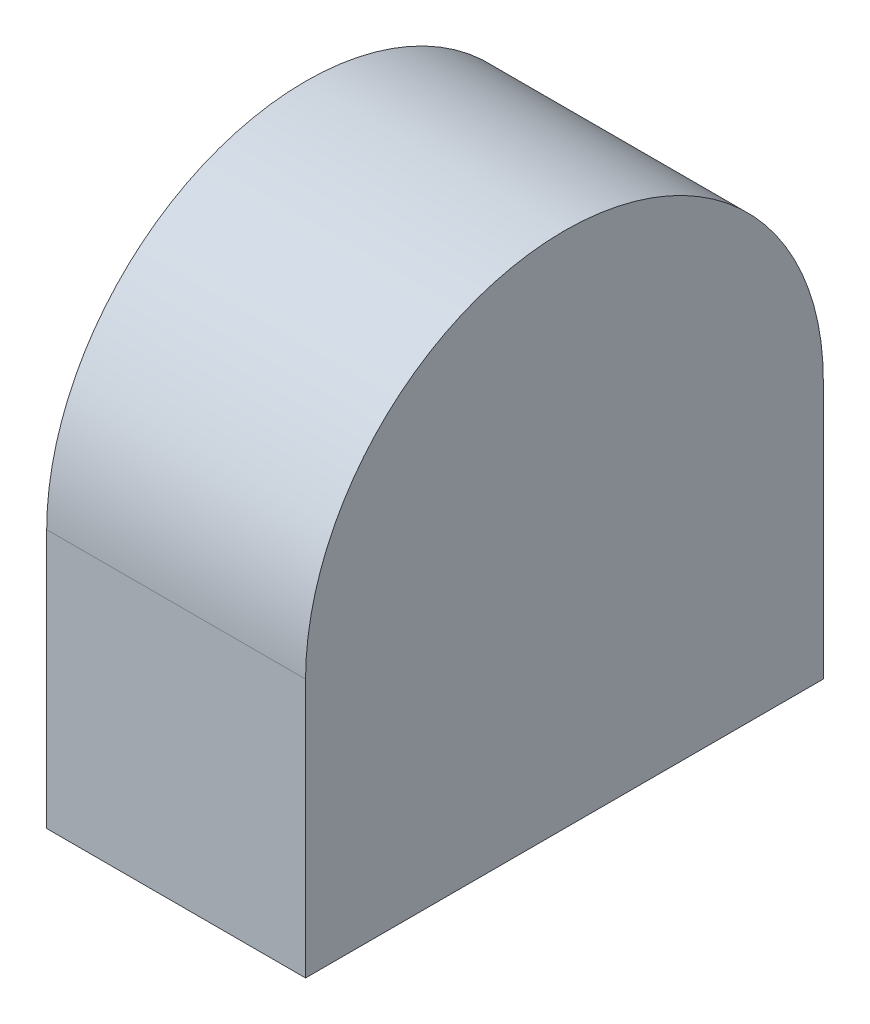
ISO-10303-21;
HEADER;
FILE_DESCRIPTION(('STEP AP214'),'2;1');
FILE_NAME('part.step','',(''),(''),'','','');
FILE_SCHEMA(('AUTOMOTIVE_DESIGN { 1 0 10303 214 1 1 1 1 }'));
ENDSEC;
DATA;
#1=APPLICATION_CONTEXT('core data for automotive mechanical design processes');
#2=APPLICATION_PROTOCOL_DEFINITION('international standard','automotive_design',2000,#1);
#3=PRODUCT_CONTEXT('',#1,'mechanical');
#4=PRODUCT('Part','Part','',(#3));
#5=PRODUCT_RELATED_PRODUCT_CATEGORY('part','',(#4));
#6=PRODUCT_DEFINITION_FORMATION('','',#4);
#7=PRODUCT_DEFINITION_CONTEXT('part definition',#1,'design');
#8=PRODUCT_DEFINITION('design','',#6,#7);
#9=PRODUCT_DEFINITION_SHAPE('','',#8);
#10=(LENGTH_UNIT() NAMED_UNIT(*) SI_UNIT(.MILLI.,.METRE.));
#11=(NAMED_UNIT(*) PLANE_ANGLE_UNIT() SI_UNIT($,.RADIAN.));
#12=(NAMED_UNIT(*) SI_UNIT($,.STERADIAN.) SOLID_ANGLE_UNIT());
#13=UNCERTAINTY_MEASURE_WITH_UNIT(LENGTH_MEASURE(1.E-05),#10,'distance_accuracy_value','');
#14=(GEOMETRIC_REPRESENTATION_CONTEXT(3) GLOBAL_UNCERTAINTY_ASSIGNED_CONTEXT((#13)) GLOBAL_UNIT_ASSIGNED_CONTEXT((#10,
#11,#12)) REPRESENTATION_CONTEXT('',''));
#15=CARTESIAN_POINT('',(0.,0.,0.));
#16=DIRECTION('',(0.,0.,1.));
#17=DIRECTION('',(1.,0.,0.));
#18=AXIS2_PLACEMENT_3D('',#15,#16,#17);
#19=CARTESIAN_POINT('',(0.,10.,-10.));
#20=DIRECTION('',(-1.,0.,0.));
#21=DIRECTION('',(0.,0.,1.));
#22=AXIS2_PLACEMENT_3D('',#19,#20,#21);
#23=CYLINDRICAL_SURFACE('',#22,10.);
#24=DIRECTION('',(-1.,0.,0.));
#25=VECTOR('',#24,1.);
#26=CARTESIAN_POINT('',(0.,10.,-20.));
#27=LINE('',#26,#25);
#28=CARTESIAN_POINT('',(0.,10.,-20.));
#29=VERTEX_POINT('',#28);
#30=CARTESIAN_POINT('',(10.,10.,-20.));
#31=VERTEX_POINT('',#30);
#32=EDGE_CURVE('E96',#29,#31,#27,.F.);
#33=ORIENTED_EDGE('',*,*,#32,.F.);
#34=CARTESIAN_POINT('',(0.,10.,-10.));
#35=DIRECTION('',(1.,0.,0.));
#36=DIRECTION('',(0.,0.,-1.));
#37=AXIS2_PLACEMENT_3D('',#34,#35,#36);
#38=CIRCLE('',#37,10.);
#39=CARTESIAN_POINT('',(0.,10.,0.));
#40=VERTEX_POINT('',#39);
#41=EDGE_CURVE('E56',#40,#29,#38,.F.);
#42=ORIENTED_EDGE('',*,*,#41,.F.);
#43=DIRECTION('',(-1.,0.,0.));
#44=VECTOR('',#43,1.);
#45=CARTESIAN_POINT('',(0.,10.,0.));
#46=LINE('',#45,#44);
#47=CARTESIAN_POINT('',(10.,10.,0.));
#48=VERTEX_POINT('',#47);
#49=EDGE_CURVE('E92',#48,#40,#46,.T.);
#50=ORIENTED_EDGE('',*,*,#49,.F.);
#51=CARTESIAN_POINT('',(10.,10.,-10.));
#52=DIRECTION('',(-1.,0.,0.));
#53=DIRECTION('',(0.,0.,1.));
#54=AXIS2_PLACEMENT_3D('',#51,#52,#53);
#55=CIRCLE('',#54,10.);
#56=EDGE_CURVE('E11',#31,#48,#55,.F.);
#57=ORIENTED_EDGE('',*,*,#56,.F.);
#58=EDGE_LOOP('',(#33,#42,#50,#57));
#59=FACE_BOUND('',#58,.T.);
#60=ADVANCED_FACE('F47',(#59),#23,.T.);
#61=CARTESIAN_POINT('',(0.,20.,0.));
#62=DIRECTION('',(1.,0.,0.));
#63=DIRECTION('',(0.,0.,-1.));
#64=AXIS2_PLACEMENT_3D('',#61,#62,#63);
#65=PLANE('',#64);
#66=CARTESIAN_POINT('',(0.,13.,-10.));
#67=DIRECTION('',(-1.,0.,0.));
#68=DIRECTION('',(0.,0.,1.));
#69=AXIS2_PLACEMENT_3D('',#66,#67,#68);
#70=CIRCLE('',#69,2.);
#71=CARTESIAN_POINT('',(0.,13.,-8.));
#72=VERTEX_POINT('',#71);
#73=EDGE_CURVE('E117',#72,#72,#70,.T.);
#74=ORIENTED_EDGE('',*,*,#73,.F.);
#75=EDGE_LOOP('',(#74));
#76=FACE_BOUND('',#75,.T.);
#77=DIRECTION('',(0.,-1.,0.));
#78=VECTOR('',#77,1.);
#79=CARTESIAN_POINT('',(0.,20.,0.));
#80=LINE('',#79,#78);
#81=CARTESIAN_POINT('',(0.,0.,0.));
#82=VERTEX_POINT('',#81);
#83=EDGE_CURVE('E86',#40,#82,#80,.T.);
#84=ORIENTED_EDGE('',*,*,#83,.F.);
#85=ORIENTED_EDGE('',*,*,#41,.T.);
#86=DIRECTION('',(0.,-1.,0.));
#87=VECTOR('',#86,1.);
#88=CARTESIAN_POINT('',(0.,20.,-20.));
#89=LINE('',#88,#87);
#90=CARTESIAN_POINT('',(0.,0.,-20.));
#91=VERTEX_POINT('',#90);
#92=EDGE_CURVE('E110',#29,#91,#89,.T.);
#93=ORIENTED_EDGE('',*,*,#92,.T.);
#94=DIRECTION('',(0.,0.,1.));
#95=VECTOR('',#94,1.);
#96=CARTESIAN_POINT('',(0.,0.,0.));
#97=LINE('',#96,#95);
#98=EDGE_CURVE('E103',#91,#82,#97,.T.);
#99=ORIENTED_EDGE('',*,*,#98,.T.);
#100=EDGE_LOOP('',(#84,#85,#93,#99));
#101=FACE_BOUND('',#100,.T.);
#102=ADVANCED_FACE('F108',(#76,#101),#65,.F.);
#103=CARTESIAN_POINT('',(0.,20.,0.));
#104=DIRECTION('',(0.,0.,-1.));
#105=DIRECTION('',(-1.,0.,0.));
#106=AXIS2_PLACEMENT_3D('',#103,#104,#105);
#107=PLANE('',#106);
#108=DIRECTION('',(0.,-1.,0.));
#109=VECTOR('',#108,1.);
#110=CARTESIAN_POINT('',(10.,20.,0.));
#111=LINE('',#110,#109);
#112=CARTESIAN_POINT('',(10.,0.,0.));
#113=VERTEX_POINT('',#112);
#114=EDGE_CURVE('E97',#48,#113,#111,.T.);
#115=ORIENTED_EDGE('',*,*,#114,.F.);
#116=ORIENTED_EDGE('',*,*,#49,.T.);
#117=ORIENTED_EDGE('',*,*,#83,.T.);
#118=DIRECTION('',(1.,0.,0.));
#119=VECTOR('',#118,1.);
#120=CARTESIAN_POINT('',(0.,0.,0.));
#121=LINE('',#120,#119);
#122=EDGE_CURVE('E90',#82,#113,#121,.T.);
#123=ORIENTED_EDGE('',*,*,#122,.T.);
#124=EDGE_LOOP('',(#115,#116,#117,#123));
#125=FACE_BOUND('',#124,.T.);
#126=ADVANCED_FACE('F89',(#125),#107,.F.);
#127=CARTESIAN_POINT('',(10.,20.,0.));
#128=DIRECTION('',(-1.,0.,0.));
#129=DIRECTION('',(0.,0.,1.));
#130=AXIS2_PLACEMENT_3D('',#127,#128,#129);
#131=PLANE('',#130);
#132=DIRECTION('',(0.,-1.,0.));
#133=VECTOR('',#132,1.);
#134=CARTESIAN_POINT('',(10.,20.,-20.));
#135=LINE('',#134,#133);
#136=CARTESIAN_POINT('',(10.,0.,-20.));
#137=VERTEX_POINT('',#136);
#138=EDGE_CURVE('E128',#31,#137,#135,.T.);
#139=ORIENTED_EDGE('',*,*,#138,.F.);
#140=ORIENTED_EDGE('',*,*,#56,.T.);
#141=ORIENTED_EDGE('',*,*,#114,.T.);
#142=DIRECTION('',(0.,0.,-1.));
#143=VECTOR('',#142,1.);
#144=CARTESIAN_POINT('',(10.,0.,0.));
#145=LINE('',#144,#143);
#146=EDGE_CURVE('E105',#113,#137,#145,.T.);
#147=ORIENTED_EDGE('',*,*,#146,.T.);
#148=EDGE_LOOP('',(#139,#140,#141,#147));
#149=FACE_BOUND('',#148,.T.);
#150=ADVANCED_FACE('F140',(#149),#131,.F.);
#151=CARTESIAN_POINT('',(0.,20.,-20.));
#152=DIRECTION('',(0.,0.,1.));
#153=DIRECTION('',(1.,0.,0.));
#154=AXIS2_PLACEMENT_3D('',#151,#152,#153);
#155=PLANE('',#154);
#156=ORIENTED_EDGE('',*,*,#92,.F.);
#157=ORIENTED_EDGE('',*,*,#32,.T.);
#158=ORIENTED_EDGE('',*,*,#138,.T.);
#159=DIRECTION('',(-1.,0.,0.));
#160=VECTOR('',#159,1.);
#161=CARTESIAN_POINT('',(0.,0.,-20.));
#162=LINE('',#161,#160);
#163=EDGE_CURVE('E123',#137,#91,#162,.T.);
#164=ORIENTED_EDGE('',*,*,#163,.T.);
#165=EDGE_LOOP('',(#156,#157,#158,#164));
#166=FACE_BOUND('',#165,.T.);
#167=ADVANCED_FACE('F139',(#166),#155,.F.);
#168=CARTESIAN_POINT('',(0.,0.,0.));
#169=DIRECTION('',(0.,-1.,0.));
#170=DIRECTION('',(0.,0.,-1.));
#171=AXIS2_PLACEMENT_3D('',#168,#169,#170);
#172=PLANE('',#171);
#173=ORIENTED_EDGE('',*,*,#98,.F.);
#174=ORIENTED_EDGE('',*,*,#163,.F.);
#175=ORIENTED_EDGE('',*,*,#146,.F.);
#176=ORIENTED_EDGE('',*,*,#122,.F.);
#177=EDGE_LOOP('',(#173,#174,#175,#176));
#178=FACE_BOUND('',#177,.T.);
#179=ADVANCED_FACE('F101',(#178),#172,.T.);
#180=CARTESIAN_POINT('',(3.,13.,-10.));
#181=DIRECTION('',(-1.,0.,0.));
#182=DIRECTION('',(0.,0.,1.));
#183=AXIS2_PLACEMENT_3D('',#180,#181,#182);
#184=CYLINDRICAL_SURFACE('',#183,2.);
#185=CARTESIAN_POINT('',(3.,13.,-10.));
#186=DIRECTION('',(-1.,0.,0.));
#187=DIRECTION('',(0.,0.,1.));
#188=AXIS2_PLACEMENT_3D('',#185,#186,#187);
#189=CIRCLE('',#188,2.);
#190=CARTESIAN_POINT('',(3.,13.,-8.));
#191=VERTEX_POINT('',#190);
#192=EDGE_CURVE('E113',#191,#191,#189,.T.);
#193=ORIENTED_EDGE('',*,*,#192,.F.);
#194=EDGE_LOOP('',(#193));
#195=FACE_BOUND('',#194,.T.);
#196=ORIENTED_EDGE('',*,*,#73,.T.);
#197=EDGE_LOOP('',(#196));
#198=FACE_BOUND('',#197,.T.);
#199=ADVANCED_FACE('F161',(#195,#198),#184,.F.);
#200=CARTESIAN_POINT('',(3.,13.,-10.));
#201=DIRECTION('',(-1.,0.,0.));
#202=DIRECTION('',(0.,0.,1.));
#203=AXIS2_PLACEMENT_3D('',#200,#201,#202);
#204=PLANE('',#203);
#205=ORIENTED_EDGE('',*,*,#192,.T.);
#206=EDGE_LOOP('',(#205));
#207=FACE_BOUND('',#206,.T.);
#208=ADVANCED_FACE('F163',(#207),#204,.T.);
#209=CLOSED_SHELL('',(#60,#102,#126,#150,#167,#179,#199,#208));
#210=MANIFOLD_SOLID_BREP('B2',#209);
#211=ADVANCED_BREP_SHAPE_REPRESENTATION('',(#18,#210),#14);
#212=SHAPE_DEFINITION_REPRESENTATION(#9,#211);
ENDSEC;
END-ISO-10303-21;
